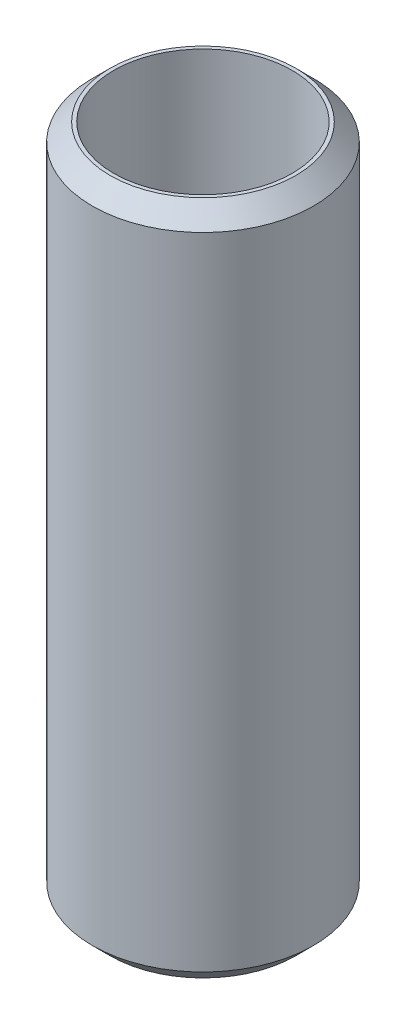
ISO-10303-21;
HEADER;
FILE_DESCRIPTION(('STEP AP214'),'2;1');
FILE_NAME('part.step','',(''),(''),'','','');
FILE_SCHEMA(('AUTOMOTIVE_DESIGN { 1 0 10303 214 1 1 1 1 }'));
ENDSEC;
DATA;
#1=APPLICATION_CONTEXT('core data for automotive mechanical design processes');
#2=APPLICATION_PROTOCOL_DEFINITION('international standard','automotive_design',2000,#1);
#3=PRODUCT_CONTEXT('',#1,'mechanical');
#4=PRODUCT('Part','Part','',(#3));
#5=PRODUCT_RELATED_PRODUCT_CATEGORY('part','',(#4));
#6=PRODUCT_DEFINITION_FORMATION('','',#4);
#7=PRODUCT_DEFINITION_CONTEXT('part definition',#1,'design');
#8=PRODUCT_DEFINITION('design','',#6,#7);
#9=PRODUCT_DEFINITION_SHAPE('','',#8);
#10=(LENGTH_UNIT() NAMED_UNIT(*) SI_UNIT(.MILLI.,.METRE.));
#11=(NAMED_UNIT(*) PLANE_ANGLE_UNIT() SI_UNIT($,.RADIAN.));
#12=(NAMED_UNIT(*) SI_UNIT($,.STERADIAN.) SOLID_ANGLE_UNIT());
#13=UNCERTAINTY_MEASURE_WITH_UNIT(LENGTH_MEASURE(1.E-05),#10,'distance_accuracy_value','');
#14=(GEOMETRIC_REPRESENTATION_CONTEXT(3) GLOBAL_UNCERTAINTY_ASSIGNED_CONTEXT((#13)) GLOBAL_UNIT_ASSIGNED_CONTEXT((#10,
#11,#12)) REPRESENTATION_CONTEXT('',''));
#15=CARTESIAN_POINT('',(0.,0.,0.));
#16=DIRECTION('',(0.,0.,1.));
#17=DIRECTION('',(1.,0.,0.));
#18=AXIS2_PLACEMENT_3D('',#15,#16,#17);
#19=CARTESIAN_POINT('',(0.,198.631097981005,0.));
#20=DIRECTION('',(0.,-1.,0.));
#21=DIRECTION('',(0.,0.,-1.));
#22=AXIS2_PLACEMENT_3D('',#19,#20,#21);
#23=CYLINDRICAL_SURFACE('',#22,32.5);
#24=CARTESIAN_POINT('',(0.,193.438376758172,0.));
#25=DIRECTION('',(0.,1.,0.));
#26=DIRECTION('',(0.,0.,1.));
#27=AXIS2_PLACEMENT_3D('',#24,#25,#26);
#28=CIRCLE('',#27,32.5);
#29=CARTESIAN_POINT('',(0.,193.438376758172,32.5));
#30=VERTEX_POINT('',#29);
#31=EDGE_CURVE('E50',#30,#30,#28,.F.);
#32=ORIENTED_EDGE('',*,*,#31,.T.);
#33=EDGE_LOOP('',(#32));
#34=FACE_BOUND('',#33,.T.);
#35=CARTESIAN_POINT('',(0.,5.1927212228331,0.));
#36=DIRECTION('',(0.,1.,0.));
#37=DIRECTION('',(0.,0.,1.));
#38=AXIS2_PLACEMENT_3D('',#35,#36,#37);
#39=CIRCLE('',#38,32.5);
#40=CARTESIAN_POINT('',(0.,5.1927212228331,32.5));
#41=VERTEX_POINT('',#40);
#42=EDGE_CURVE('E51',#41,#41,#39,.T.);
#43=ORIENTED_EDGE('',*,*,#42,.T.);
#44=EDGE_LOOP('',(#43));
#45=FACE_BOUND('',#44,.T.);
#46=ADVANCED_FACE('F39',(#34,#45),#23,.T.);
#47=CARTESIAN_POINT('',(0.,198.631097981005,0.));
#48=DIRECTION('',(0.,1.,0.));
#49=DIRECTION('',(0.,0.,1.));
#50=AXIS2_PLACEMENT_3D('',#47,#48,#49);
#51=PLANE('',#50);
#52=CARTESIAN_POINT('',(0.,198.631097981005,0.));
#53=DIRECTION('',(0.,1.,0.));
#54=DIRECTION('',(0.,0.,1.));
#55=AXIS2_PLACEMENT_3D('',#52,#53,#54);
#56=CIRCLE('',#55,27.3072787771669);
#57=CARTESIAN_POINT('',(0.,198.631097981005,27.3072787771669));
#58=VERTEX_POINT('',#57);
#59=EDGE_CURVE('E54',#58,#58,#56,.T.);
#60=ORIENTED_EDGE('',*,*,#59,.T.);
#61=EDGE_LOOP('',(#60));
#62=FACE_BOUND('',#61,.T.);
#63=CARTESIAN_POINT('',(0.,198.631097981005,0.));
#64=DIRECTION('',(0.,1.,0.));
#65=DIRECTION('',(0.,0.,1.));
#66=AXIS2_PLACEMENT_3D('',#63,#64,#65);
#67=CIRCLE('',#66,26.2408165506382);
#68=CARTESIAN_POINT('',(0.,198.631097981005,26.2408165506382));
#69=VERTEX_POINT('',#68);
#70=EDGE_CURVE('E58',#69,#69,#67,.T.);
#71=ORIENTED_EDGE('',*,*,#70,.F.);
#72=EDGE_LOOP('',(#71));
#73=FACE_BOUND('',#72,.T.);
#74=ADVANCED_FACE('F69',(#62,#73),#51,.T.);
#75=CARTESIAN_POINT('',(0.,0.,0.));
#76=DIRECTION('',(0.,1.,0.));
#77=DIRECTION('',(0.,0.,1.));
#78=AXIS2_PLACEMENT_3D('',#75,#76,#77);
#79=PLANE('',#78);
#80=CARTESIAN_POINT('',(0.,0.,0.));
#81=DIRECTION('',(0.,1.,0.));
#82=DIRECTION('',(0.,0.,1.));
#83=AXIS2_PLACEMENT_3D('',#80,#81,#82);
#84=CIRCLE('',#83,27.3072787771669);
#85=CARTESIAN_POINT('',(0.,0.,27.3072787771669));
#86=VERTEX_POINT('',#85);
#87=EDGE_CURVE('E10',#86,#86,#84,.F.);
#88=ORIENTED_EDGE('',*,*,#87,.T.);
#89=EDGE_LOOP('',(#88));
#90=FACE_BOUND('',#89,.T.);
#91=CARTESIAN_POINT('',(0.,0.,0.));
#92=DIRECTION('',(0.,1.,0.));
#93=DIRECTION('',(0.,0.,1.));
#94=AXIS2_PLACEMENT_3D('',#91,#92,#93);
#95=CIRCLE('',#94,26.2408165506382);
#96=CARTESIAN_POINT('',(0.,0.,26.2408165506382));
#97=VERTEX_POINT('',#96);
#98=EDGE_CURVE('E63',#97,#97,#95,.T.);
#99=ORIENTED_EDGE('',*,*,#98,.T.);
#100=EDGE_LOOP('',(#99));
#101=FACE_BOUND('',#100,.T.);
#102=ADVANCED_FACE('F75',(#90,#101),#79,.F.);
#103=CARTESIAN_POINT('',(0.,198.631097981005,0.));
#104=DIRECTION('',(0.,-1.,0.));
#105=DIRECTION('',(0.,0.,-1.));
#106=AXIS2_PLACEMENT_3D('',#103,#104,#105);
#107=CYLINDRICAL_SURFACE('',#106,26.2408165506382);
#108=ORIENTED_EDGE('',*,*,#70,.T.);
#109=EDGE_LOOP('',(#108));
#110=FACE_BOUND('',#109,.T.);
#111=ORIENTED_EDGE('',*,*,#98,.F.);
#112=EDGE_LOOP('',(#111));
#113=FACE_BOUND('',#112,.T.);
#114=ADVANCED_FACE('F70',(#110,#113),#107,.F.);
#115=CARTESIAN_POINT('',(0.,198.631097981005,0.));
#116=DIRECTION('',(0.,-1.,0.));
#117=DIRECTION('',(0.,0.,-1.));
#118=AXIS2_PLACEMENT_3D('',#115,#116,#117);
#119=CONICAL_SURFACE('',#118,27.3072787771669,0.785398163397443);
#120=ORIENTED_EDGE('',*,*,#31,.F.);
#121=EDGE_LOOP('',(#120));
#122=FACE_BOUND('',#121,.T.);
#123=ORIENTED_EDGE('',*,*,#59,.F.);
#124=EDGE_LOOP('',(#123));
#125=FACE_BOUND('',#124,.T.);
#126=ADVANCED_FACE('F81',(#122,#125),#119,.T.);
#127=CARTESIAN_POINT('',(0.,5.1927212228331,0.));
#128=DIRECTION('',(0.,1.,0.));
#129=DIRECTION('',(0.,0.,1.));
#130=AXIS2_PLACEMENT_3D('',#127,#128,#129);
#131=CONICAL_SURFACE('',#130,32.5,0.785398163397454);
#132=ORIENTED_EDGE('',*,*,#87,.F.);
#133=EDGE_LOOP('',(#132));
#134=FACE_BOUND('',#133,.T.);
#135=ORIENTED_EDGE('',*,*,#42,.F.);
#136=EDGE_LOOP('',(#135));
#137=FACE_BOUND('',#136,.T.);
#138=ADVANCED_FACE('F45',(#134,#137),#131,.T.);
#139=CLOSED_SHELL('',(#46,#74,#102,#114,#126,#138));
#140=MANIFOLD_SOLID_BREP('B2',#139);
#141=ADVANCED_BREP_SHAPE_REPRESENTATION('',(#18,#140),#14);
#142=SHAPE_DEFINITION_REPRESENTATION(#9,#141);
ENDSEC;
END-ISO-10303-21;
